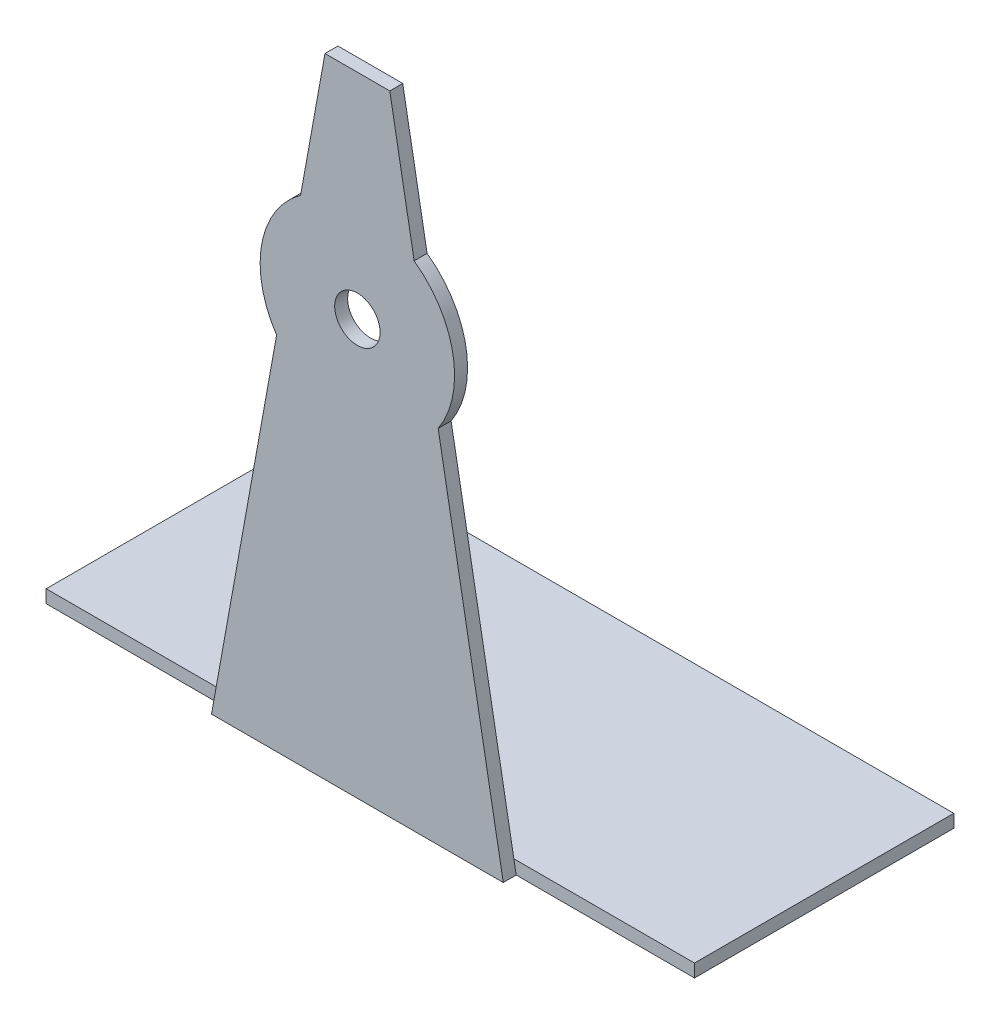
ISO-10303-21;
HEADER;
FILE_DESCRIPTION(('STEP AP214'),'2;1');
FILE_NAME('part.step','',(''),(''),'','','');
FILE_SCHEMA(('AUTOMOTIVE_DESIGN { 1 0 10303 214 1 1 1 1 }'));
ENDSEC;
DATA;
#1=APPLICATION_CONTEXT('core data for automotive mechanical design processes');
#2=APPLICATION_PROTOCOL_DEFINITION('international standard','automotive_design',2000,#1);
#3=PRODUCT_CONTEXT('',#1,'mechanical');
#4=PRODUCT('Part','Part','',(#3));
#5=PRODUCT_RELATED_PRODUCT_CATEGORY('part','',(#4));
#6=PRODUCT_DEFINITION_FORMATION('','',#4);
#7=PRODUCT_DEFINITION_CONTEXT('part definition',#1,'design');
#8=PRODUCT_DEFINITION('design','',#6,#7);
#9=PRODUCT_DEFINITION_SHAPE('','',#8);
#10=(LENGTH_UNIT() NAMED_UNIT(*) SI_UNIT(.MILLI.,.METRE.));
#11=(NAMED_UNIT(*) PLANE_ANGLE_UNIT() SI_UNIT($,.RADIAN.));
#12=(NAMED_UNIT(*) SI_UNIT($,.STERADIAN.) SOLID_ANGLE_UNIT());
#13=UNCERTAINTY_MEASURE_WITH_UNIT(LENGTH_MEASURE(1.E-05),#10,'distance_accuracy_value','');
#14=(GEOMETRIC_REPRESENTATION_CONTEXT(3) GLOBAL_UNCERTAINTY_ASSIGNED_CONTEXT((#13)) GLOBAL_UNIT_ASSIGNED_CONTEXT((#10,
#11,#12)) REPRESENTATION_CONTEXT('',''));
#15=CARTESIAN_POINT('',(0.,0.,0.));
#16=DIRECTION('',(0.,0.,1.));
#17=DIRECTION('',(1.,0.,0.));
#18=AXIS2_PLACEMENT_3D('',#15,#16,#17);
#19=CARTESIAN_POINT('',(0.,2.,0.));
#20=DIRECTION('',(0.,0.,-1.));
#21=DIRECTION('',(-1.,0.,0.));
#22=AXIS2_PLACEMENT_3D('',#19,#20,#21);
#23=PLANE('',#22);
#24=DIRECTION('',(-0.177546067858129,0.98411249041363,0.));
#25=VECTOR('',#24,1.);
#26=CARTESIAN_POINT('',(72.5,0.,0.));
#27=LINE('',#26,#25);
#28=CARTESIAN_POINT('',(72.5,0.,0.));
#29=VERTEX_POINT('',#28);
#30=CARTESIAN_POINT('',(72.139175257732,2.,0.));
#31=VERTEX_POINT('',#30);
#32=EDGE_CURVE('E249',#29,#31,#27,.T.);
#33=ORIENTED_EDGE('',*,*,#32,.F.);
#34=DIRECTION('',(1.,0.,0.));
#35=VECTOR('',#34,1.);
#36=CARTESIAN_POINT('',(0.,0.,0.));
#37=LINE('',#36,#35);
#38=CARTESIAN_POINT('',(100.,0.,0.));
#39=VERTEX_POINT('',#38);
#40=EDGE_CURVE('E169',#29,#39,#37,.T.);
#41=ORIENTED_EDGE('',*,*,#40,.T.);
#42=DIRECTION('',(0.,-1.,0.));
#43=VECTOR('',#42,1.);
#44=CARTESIAN_POINT('',(100.,2.,0.));
#45=LINE('',#44,#43);
#46=CARTESIAN_POINT('',(100.,2.,0.));
#47=VERTEX_POINT('',#46);
#48=EDGE_CURVE('E205',#47,#39,#45,.T.);
#49=ORIENTED_EDGE('',*,*,#48,.F.);
#50=DIRECTION('',(1.,0.,0.));
#51=VECTOR('',#50,1.);
#52=CARTESIAN_POINT('',(0.,2.,0.));
#53=LINE('',#52,#51);
#54=EDGE_CURVE('E57',#31,#47,#53,.T.);
#55=ORIENTED_EDGE('',*,*,#54,.F.);
#56=EDGE_LOOP('',(#33,#41,#49,#55));
#57=FACE_BOUND('',#56,.T.);
#58=ADVANCED_FACE('F39',(#57),#23,.F.);
#59=DIRECTION('',(-0.177546067858129,-0.98411249041363,0.));
#60=VECTOR('',#59,1.);
#61=CARTESIAN_POINT('',(27.5,0.,0.));
#62=LINE('',#61,#60);
#63=CARTESIAN_POINT('',(27.860824742268,2.,0.));
#64=VERTEX_POINT('',#63);
#65=CARTESIAN_POINT('',(27.5,0.,0.));
#66=VERTEX_POINT('',#65);
#67=EDGE_CURVE('E11',#64,#66,#62,.T.);
#68=ORIENTED_EDGE('',*,*,#67,.F.);
#69=CARTESIAN_POINT('',(0.,2.,0.));
#70=VERTEX_POINT('',#69);
#71=EDGE_CURVE('E180',#70,#64,#53,.T.);
#72=ORIENTED_EDGE('',*,*,#71,.F.);
#73=DIRECTION('',(0.,-1.,0.));
#74=VECTOR('',#73,1.);
#75=CARTESIAN_POINT('',(0.,2.,0.));
#76=LINE('',#75,#74);
#77=CARTESIAN_POINT('',(0.,0.,0.));
#78=VERTEX_POINT('',#77);
#79=EDGE_CURVE('E43',#70,#78,#76,.T.);
#80=ORIENTED_EDGE('',*,*,#79,.T.);
#81=EDGE_CURVE('E191',#78,#66,#37,.T.);
#82=ORIENTED_EDGE('',*,*,#81,.T.);
#83=EDGE_LOOP('',(#68,#72,#80,#82));
#84=FACE_BOUND('',#83,.T.);
#85=ADVANCED_FACE('F214',(#84),#23,.F.);
#86=CARTESIAN_POINT('',(0.,2.,0.));
#87=DIRECTION('',(1.,0.,0.));
#88=DIRECTION('',(0.,0.,-1.));
#89=AXIS2_PLACEMENT_3D('',#86,#87,#88);
#90=PLANE('',#89);
#91=DIRECTION('',(0.,0.,1.));
#92=VECTOR('',#91,1.);
#93=CARTESIAN_POINT('',(0.,0.,0.));
#94=LINE('',#93,#92);
#95=CARTESIAN_POINT('',(0.,0.,-40.));
#96=VERTEX_POINT('',#95);
#97=EDGE_CURVE('E164',#96,#78,#94,.T.);
#98=ORIENTED_EDGE('',*,*,#97,.T.);
#99=ORIENTED_EDGE('',*,*,#79,.F.);
#100=DIRECTION('',(0.,0.,1.));
#101=VECTOR('',#100,1.);
#102=CARTESIAN_POINT('',(0.,2.,0.));
#103=LINE('',#102,#101);
#104=CARTESIAN_POINT('',(0.,2.,-40.));
#105=VERTEX_POINT('',#104);
#106=EDGE_CURVE('E175',#105,#70,#103,.T.);
#107=ORIENTED_EDGE('',*,*,#106,.F.);
#108=DIRECTION('',(0.,-1.,0.));
#109=VECTOR('',#108,1.);
#110=CARTESIAN_POINT('',(0.,2.,-40.));
#111=LINE('',#110,#109);
#112=EDGE_CURVE('E189',#105,#96,#111,.T.);
#113=ORIENTED_EDGE('',*,*,#112,.T.);
#114=EDGE_LOOP('',(#98,#99,#107,#113));
#115=FACE_BOUND('',#114,.T.);
#116=ADVANCED_FACE('F41',(#115),#90,.F.);
#117=CARTESIAN_POINT('',(100.,2.,0.));
#118=DIRECTION('',(-1.,0.,0.));
#119=DIRECTION('',(0.,0.,1.));
#120=AXIS2_PLACEMENT_3D('',#117,#118,#119);
#121=PLANE('',#120);
#122=DIRECTION('',(0.,0.,-1.));
#123=VECTOR('',#122,1.);
#124=CARTESIAN_POINT('',(100.,0.,0.));
#125=LINE('',#124,#123);
#126=CARTESIAN_POINT('',(100.,0.,-40.));
#127=VERTEX_POINT('',#126);
#128=EDGE_CURVE('E194',#39,#127,#125,.T.);
#129=ORIENTED_EDGE('',*,*,#128,.T.);
#130=DIRECTION('',(0.,-1.,0.));
#131=VECTOR('',#130,1.);
#132=CARTESIAN_POINT('',(100.,2.,-40.));
#133=LINE('',#132,#131);
#134=CARTESIAN_POINT('',(100.,2.,-40.));
#135=VERTEX_POINT('',#134);
#136=EDGE_CURVE('E202',#135,#127,#133,.T.);
#137=ORIENTED_EDGE('',*,*,#136,.F.);
#138=DIRECTION('',(0.,0.,-1.));
#139=VECTOR('',#138,1.);
#140=CARTESIAN_POINT('',(100.,2.,0.));
#141=LINE('',#140,#139);
#142=EDGE_CURVE('E183',#47,#135,#141,.T.);
#143=ORIENTED_EDGE('',*,*,#142,.F.);
#144=ORIENTED_EDGE('',*,*,#48,.T.);
#145=EDGE_LOOP('',(#129,#137,#143,#144));
#146=FACE_BOUND('',#145,.T.);
#147=ADVANCED_FACE('F312',(#146),#121,.F.);
#148=CARTESIAN_POINT('',(0.,2.,-40.));
#149=DIRECTION('',(0.,0.,1.));
#150=DIRECTION('',(1.,0.,0.));
#151=AXIS2_PLACEMENT_3D('',#148,#149,#150);
#152=PLANE('',#151);
#153=DIRECTION('',(-1.,0.,0.));
#154=VECTOR('',#153,1.);
#155=CARTESIAN_POINT('',(0.,0.,-40.));
#156=LINE('',#155,#154);
#157=EDGE_CURVE('E179',#127,#96,#156,.T.);
#158=ORIENTED_EDGE('',*,*,#157,.T.);
#159=ORIENTED_EDGE('',*,*,#112,.F.);
#160=DIRECTION('',(-1.,0.,0.));
#161=VECTOR('',#160,1.);
#162=CARTESIAN_POINT('',(0.,2.,-40.));
#163=LINE('',#162,#161);
#164=EDGE_CURVE('E187',#135,#105,#163,.T.);
#165=ORIENTED_EDGE('',*,*,#164,.F.);
#166=ORIENTED_EDGE('',*,*,#136,.T.);
#167=EDGE_LOOP('',(#158,#159,#165,#166));
#168=FACE_BOUND('',#167,.T.);
#169=ADVANCED_FACE('F315',(#168),#152,.F.);
#170=CARTESIAN_POINT('',(0.,2.,0.));
#171=DIRECTION('',(0.,-1.,0.));
#172=DIRECTION('',(0.,0.,-1.));
#173=AXIS2_PLACEMENT_3D('',#170,#171,#172);
#174=PLANE('',#173);
#175=ORIENTED_EDGE('',*,*,#106,.T.);
#176=ORIENTED_EDGE('',*,*,#71,.T.);
#177=EDGE_CURVE('E184',#64,#31,#53,.T.);
#178=ORIENTED_EDGE('',*,*,#177,.T.);
#179=ORIENTED_EDGE('',*,*,#54,.T.);
#180=ORIENTED_EDGE('',*,*,#142,.T.);
#181=ORIENTED_EDGE('',*,*,#164,.T.);
#182=EDGE_LOOP('',(#175,#176,#178,#179,#180,#181));
#183=FACE_BOUND('',#182,.T.);
#184=ADVANCED_FACE('F310',(#183),#174,.F.);
#185=CARTESIAN_POINT('',(0.,0.,0.));
#186=DIRECTION('',(0.,-1.,0.));
#187=DIRECTION('',(0.,0.,-1.));
#188=AXIS2_PLACEMENT_3D('',#185,#186,#187);
#189=PLANE('',#188);
#190=ORIENTED_EDGE('',*,*,#97,.F.);
#191=ORIENTED_EDGE('',*,*,#157,.F.);
#192=ORIENTED_EDGE('',*,*,#128,.F.);
#193=ORIENTED_EDGE('',*,*,#40,.F.);
#194=DIRECTION('',(0.,0.,-1.));
#195=VECTOR('',#194,1.);
#196=CARTESIAN_POINT('',(72.5,0.,2.));
#197=LINE('',#196,#195);
#198=CARTESIAN_POINT('',(72.5,0.,2.));
#199=VERTEX_POINT('',#198);
#200=EDGE_CURVE('E171',#199,#29,#197,.T.);
#201=ORIENTED_EDGE('',*,*,#200,.F.);
#202=DIRECTION('',(1.,0.,0.));
#203=VECTOR('',#202,1.);
#204=CARTESIAN_POINT('',(72.5,0.,2.));
#205=LINE('',#204,#203);
#206=CARTESIAN_POINT('',(27.5,0.,2.));
#207=VERTEX_POINT('',#206);
#208=EDGE_CURVE('E147',#207,#199,#205,.T.);
#209=ORIENTED_EDGE('',*,*,#208,.F.);
#210=DIRECTION('',(0.,0.,-1.));
#211=VECTOR('',#210,1.);
#212=CARTESIAN_POINT('',(27.5,0.,2.));
#213=LINE('',#212,#211);
#214=EDGE_CURVE('E143',#207,#66,#213,.T.);
#215=ORIENTED_EDGE('',*,*,#214,.T.);
#216=ORIENTED_EDGE('',*,*,#81,.F.);
#217=EDGE_LOOP('',(#190,#191,#192,#193,#201,#209,#215,#216));
#218=FACE_BOUND('',#217,.T.);
#219=ADVANCED_FACE('F221',(#218),#189,.T.);
#220=CARTESIAN_POINT('',(50.,64.,2.));
#221=DIRECTION('',(0.,0.,-1.));
#222=DIRECTION('',(-1.,0.,0.));
#223=AXIS2_PLACEMENT_3D('',#220,#221,#222);
#224=CYLINDRICAL_SURFACE('',#223,15.);
#225=CARTESIAN_POINT('',(50.,64.,0.));
#226=DIRECTION('',(0.,0.,1.));
#227=DIRECTION('',(1.,0.,0.));
#228=AXIS2_PLACEMENT_3D('',#225,#226,#227);
#229=CIRCLE('',#228,15.);
#230=CARTESIAN_POINT('',(41.2436171170368,76.1789063058614,0.));
#231=VERTEX_POINT('',#230);
#232=CARTESIAN_POINT('',(37.5397389468833,55.648838734153,0.));
#233=VERTEX_POINT('',#232);
#234=EDGE_CURVE('E162',#231,#233,#229,.T.);
#235=ORIENTED_EDGE('',*,*,#234,.T.);
#236=DIRECTION('',(0.,0.,-1.));
#237=VECTOR('',#236,1.);
#238=CARTESIAN_POINT('',(37.5397389468833,55.648838734153,2.));
#239=LINE('',#238,#237);
#240=CARTESIAN_POINT('',(37.5397389468833,55.648838734153,2.));
#241=VERTEX_POINT('',#240);
#242=EDGE_CURVE('E140',#241,#233,#239,.T.);
#243=ORIENTED_EDGE('',*,*,#242,.F.);
#244=CARTESIAN_POINT('',(50.,64.,2.));
#245=DIRECTION('',(0.,0.,1.));
#246=DIRECTION('',(1.,0.,0.));
#247=AXIS2_PLACEMENT_3D('',#244,#245,#246);
#248=CIRCLE('',#247,15.);
#249=CARTESIAN_POINT('',(41.2436171170368,76.1789063058614,2.));
#250=VERTEX_POINT('',#249);
#251=EDGE_CURVE('E148',#250,#241,#248,.T.);
#252=ORIENTED_EDGE('',*,*,#251,.F.);
#253=DIRECTION('',(0.,0.,-1.));
#254=VECTOR('',#253,1.);
#255=CARTESIAN_POINT('',(41.2436171170368,76.1789063058614,2.));
#256=LINE('',#255,#254);
#257=EDGE_CURVE('E243',#250,#231,#256,.T.);
#258=ORIENTED_EDGE('',*,*,#257,.T.);
#259=EDGE_LOOP('',(#235,#243,#252,#258));
#260=FACE_BOUND('',#259,.T.);
#261=ADVANCED_FACE('F160',(#260),#224,.T.);
#262=CARTESIAN_POINT('',(27.5,0.,2.));
#263=DIRECTION('',(0.98411249041363,-0.177546067858129,0.));
#264=DIRECTION('',(0.177546067858129,0.98411249041363,0.));
#265=AXIS2_PLACEMENT_3D('',#262,#263,#264);
#266=PLANE('',#265);
#267=EDGE_CURVE('E50',#233,#64,#62,.T.);
#268=ORIENTED_EDGE('',*,*,#267,.T.);
#269=ORIENTED_EDGE('',*,*,#67,.T.);
#270=ORIENTED_EDGE('',*,*,#214,.F.);
#271=DIRECTION('',(-0.177546067858129,-0.98411249041363,0.));
#272=VECTOR('',#271,1.);
#273=CARTESIAN_POINT('',(27.5,0.,2.));
#274=LINE('',#273,#272);
#275=EDGE_CURVE('E135',#241,#207,#274,.T.);
#276=ORIENTED_EDGE('',*,*,#275,.F.);
#277=ORIENTED_EDGE('',*,*,#242,.T.);
#278=EDGE_LOOP('',(#268,#269,#270,#276,#277));
#279=FACE_BOUND('',#278,.T.);
#280=ADVANCED_FACE('F138',(#279),#266,.F.);
#281=CARTESIAN_POINT('',(72.5,0.,2.));
#282=DIRECTION('',(-0.98411249041363,-0.177546067858129,0.));
#283=DIRECTION('',(0.177546067858129,-0.98411249041363,0.));
#284=AXIS2_PLACEMENT_3D('',#281,#282,#283);
#285=PLANE('',#284);
#286=ORIENTED_EDGE('',*,*,#32,.T.);
#287=CARTESIAN_POINT('',(62.4602610531167,55.6488387341531,0.));
#288=VERTEX_POINT('',#287);
#289=EDGE_CURVE('E248',#31,#288,#27,.T.);
#290=ORIENTED_EDGE('',*,*,#289,.T.);
#291=DIRECTION('',(0.,0.,-1.));
#292=VECTOR('',#291,1.);
#293=CARTESIAN_POINT('',(62.4602610531167,55.6488387341531,2.));
#294=LINE('',#293,#292);
#295=CARTESIAN_POINT('',(62.4602610531167,55.6488387341531,2.));
#296=VERTEX_POINT('',#295);
#297=EDGE_CURVE('E278',#296,#288,#294,.T.);
#298=ORIENTED_EDGE('',*,*,#297,.F.);
#299=DIRECTION('',(-0.177546067858129,0.98411249041363,0.));
#300=VECTOR('',#299,1.);
#301=CARTESIAN_POINT('',(72.5,0.,2.));
#302=LINE('',#301,#300);
#303=EDGE_CURVE('E227',#199,#296,#302,.T.);
#304=ORIENTED_EDGE('',*,*,#303,.F.);
#305=ORIENTED_EDGE('',*,*,#200,.T.);
#306=EDGE_LOOP('',(#286,#290,#298,#304,#305));
#307=FACE_BOUND('',#306,.T.);
#308=ADVANCED_FACE('F283',(#307),#285,.F.);
#309=CARTESIAN_POINT('',(50.,64.,2.));
#310=DIRECTION('',(0.,0.,-1.));
#311=DIRECTION('',(-1.,0.,0.));
#312=AXIS2_PLACEMENT_3D('',#309,#310,#311);
#313=CYLINDRICAL_SURFACE('',#312,15.);
#314=CARTESIAN_POINT('',(50.,64.,0.));
#315=DIRECTION('',(0.,0.,1.));
#316=DIRECTION('',(-1.,0.,0.));
#317=AXIS2_PLACEMENT_3D('',#314,#315,#316);
#318=CIRCLE('',#317,15.);
#319=CARTESIAN_POINT('',(58.7563828829632,76.1789063058614,0.));
#320=VERTEX_POINT('',#319);
#321=EDGE_CURVE('E253',#288,#320,#318,.T.);
#322=ORIENTED_EDGE('',*,*,#321,.T.);
#323=DIRECTION('',(0.,0.,-1.));
#324=VECTOR('',#323,1.);
#325=CARTESIAN_POINT('',(58.7563828829632,76.1789063058614,2.));
#326=LINE('',#325,#324);
#327=CARTESIAN_POINT('',(58.7563828829632,76.1789063058614,2.));
#328=VERTEX_POINT('',#327);
#329=EDGE_CURVE('E274',#328,#320,#326,.T.);
#330=ORIENTED_EDGE('',*,*,#329,.F.);
#331=CARTESIAN_POINT('',(50.,64.,2.));
#332=DIRECTION('',(0.,0.,1.));
#333=DIRECTION('',(-1.,0.,0.));
#334=AXIS2_PLACEMENT_3D('',#331,#332,#333);
#335=CIRCLE('',#334,15.);
#336=EDGE_CURVE('E230',#296,#328,#335,.T.);
#337=ORIENTED_EDGE('',*,*,#336,.F.);
#338=ORIENTED_EDGE('',*,*,#297,.T.);
#339=EDGE_LOOP('',(#322,#330,#337,#338));
#340=FACE_BOUND('',#339,.T.);
#341=ADVANCED_FACE('F290',(#340),#313,.T.);
#342=CARTESIAN_POINT('',(58.7563828829632,76.1789063058614,2.));
#343=DIRECTION('',(-0.98411249041363,-0.177546067858129,0.));
#344=DIRECTION('',(0.177546067858129,-0.98411249041363,0.));
#345=AXIS2_PLACEMENT_3D('',#342,#343,#344);
#346=PLANE('',#345);
#347=DIRECTION('',(-0.177546067858129,0.98411249041363,0.));
#348=VECTOR('',#347,1.);
#349=CARTESIAN_POINT('',(58.7563828829632,76.1789063058614,0.));
#350=LINE('',#349,#348);
#351=CARTESIAN_POINT('',(55.,97.,0.));
#352=VERTEX_POINT('',#351);
#353=EDGE_CURVE('E256',#320,#352,#350,.T.);
#354=ORIENTED_EDGE('',*,*,#353,.T.);
#355=DIRECTION('',(0.,0.,-1.));
#356=VECTOR('',#355,1.);
#357=CARTESIAN_POINT('',(55.,97.,2.));
#358=LINE('',#357,#356);
#359=CARTESIAN_POINT('',(55.,97.,2.));
#360=VERTEX_POINT('',#359);
#361=EDGE_CURVE('E270',#360,#352,#358,.T.);
#362=ORIENTED_EDGE('',*,*,#361,.F.);
#363=DIRECTION('',(-0.177546067858129,0.98411249041363,0.));
#364=VECTOR('',#363,1.);
#365=CARTESIAN_POINT('',(58.7563828829632,76.1789063058614,2.));
#366=LINE('',#365,#364);
#367=EDGE_CURVE('E235',#328,#360,#366,.T.);
#368=ORIENTED_EDGE('',*,*,#367,.F.);
#369=ORIENTED_EDGE('',*,*,#329,.T.);
#370=EDGE_LOOP('',(#354,#362,#368,#369));
#371=FACE_BOUND('',#370,.T.);
#372=ADVANCED_FACE('F294',(#371),#346,.F.);
#373=CARTESIAN_POINT('',(45.,97.,2.));
#374=DIRECTION('',(0.,-1.,0.));
#375=DIRECTION('',(0.,0.,-1.));
#376=AXIS2_PLACEMENT_3D('',#373,#374,#375);
#377=PLANE('',#376);
#378=DIRECTION('',(-1.,0.,0.));
#379=VECTOR('',#378,1.);
#380=CARTESIAN_POINT('',(45.,97.,0.));
#381=LINE('',#380,#379);
#382=CARTESIAN_POINT('',(45.,97.,0.));
#383=VERTEX_POINT('',#382);
#384=EDGE_CURVE('E259',#352,#383,#381,.T.);
#385=ORIENTED_EDGE('',*,*,#384,.T.);
#386=DIRECTION('',(0.,0.,-1.));
#387=VECTOR('',#386,1.);
#388=CARTESIAN_POINT('',(45.,97.,2.));
#389=LINE('',#388,#387);
#390=CARTESIAN_POINT('',(45.,97.,2.));
#391=VERTEX_POINT('',#390);
#392=EDGE_CURVE('E266',#391,#383,#389,.T.);
#393=ORIENTED_EDGE('',*,*,#392,.F.);
#394=DIRECTION('',(-1.,0.,0.));
#395=VECTOR('',#394,1.);
#396=CARTESIAN_POINT('',(45.,97.,2.));
#397=LINE('',#396,#395);
#398=EDGE_CURVE('E238',#360,#391,#397,.T.);
#399=ORIENTED_EDGE('',*,*,#398,.F.);
#400=ORIENTED_EDGE('',*,*,#361,.T.);
#401=EDGE_LOOP('',(#385,#393,#399,#400));
#402=FACE_BOUND('',#401,.T.);
#403=ADVANCED_FACE('F299',(#402),#377,.F.);
#404=CARTESIAN_POINT('',(41.2436171170368,76.1789063058614,2.));
#405=DIRECTION('',(0.98411249041363,-0.177546067858129,0.));
#406=DIRECTION('',(0.177546067858129,0.98411249041363,0.));
#407=AXIS2_PLACEMENT_3D('',#404,#405,#406);
#408=PLANE('',#407);
#409=DIRECTION('',(-0.177546067858129,-0.98411249041363,0.));
#410=VECTOR('',#409,1.);
#411=CARTESIAN_POINT('',(41.2436171170368,76.1789063058614,0.));
#412=LINE('',#411,#410);
#413=EDGE_CURVE('E158',#383,#231,#412,.T.);
#414=ORIENTED_EDGE('',*,*,#413,.T.);
#415=ORIENTED_EDGE('',*,*,#257,.F.);
#416=DIRECTION('',(-0.177546067858129,-0.98411249041363,0.));
#417=VECTOR('',#416,1.);
#418=CARTESIAN_POINT('',(41.2436171170368,76.1789063058614,2.));
#419=LINE('',#418,#417);
#420=EDGE_CURVE('E153',#391,#250,#419,.T.);
#421=ORIENTED_EDGE('',*,*,#420,.F.);
#422=ORIENTED_EDGE('',*,*,#392,.T.);
#423=EDGE_LOOP('',(#414,#415,#421,#422));
#424=FACE_BOUND('',#423,.T.);
#425=ADVANCED_FACE('F302',(#424),#408,.F.);
#426=CARTESIAN_POINT('',(50.,64.,2.));
#427=DIRECTION('',(0.,0.,1.));
#428=DIRECTION('',(1.,0.,0.));
#429=AXIS2_PLACEMENT_3D('',#426,#427,#428);
#430=PLANE('',#429);
#431=CARTESIAN_POINT('',(50.,64.,2.));
#432=DIRECTION('',(0.,0.,1.));
#433=DIRECTION('',(1.,0.,0.));
#434=AXIS2_PLACEMENT_3D('',#431,#432,#433);
#435=CIRCLE('',#434,3.5);
#436=CARTESIAN_POINT('',(53.5,64.,2.));
#437=VERTEX_POINT('',#436);
#438=EDGE_CURVE('E457',#437,#437,#435,.T.);
#439=ORIENTED_EDGE('',*,*,#438,.F.);
#440=EDGE_LOOP('',(#439));
#441=FACE_BOUND('',#440,.T.);
#442=ORIENTED_EDGE('',*,*,#251,.T.);
#443=ORIENTED_EDGE('',*,*,#275,.T.);
#444=ORIENTED_EDGE('',*,*,#208,.T.);
#445=ORIENTED_EDGE('',*,*,#303,.T.);
#446=ORIENTED_EDGE('',*,*,#336,.T.);
#447=ORIENTED_EDGE('',*,*,#367,.T.);
#448=ORIENTED_EDGE('',*,*,#398,.T.);
#449=ORIENTED_EDGE('',*,*,#420,.T.);
#450=EDGE_LOOP('',(#442,#443,#444,#445,#446,#447,#448,#449));
#451=FACE_BOUND('',#450,.T.);
#452=ADVANCED_FACE('F151',(#441,#451),#430,.T.);
#453=CARTESIAN_POINT('',(50.,64.,0.));
#454=DIRECTION('',(0.,0.,1.));
#455=DIRECTION('',(1.,0.,0.));
#456=AXIS2_PLACEMENT_3D('',#453,#454,#455);
#457=PLANE('',#456);
#458=CARTESIAN_POINT('',(50.,64.,0.));
#459=DIRECTION('',(0.,0.,1.));
#460=DIRECTION('',(1.,0.,0.));
#461=AXIS2_PLACEMENT_3D('',#458,#459,#460);
#462=CIRCLE('',#461,3.5);
#463=CARTESIAN_POINT('',(53.5,64.,0.));
#464=VERTEX_POINT('',#463);
#465=EDGE_CURVE('E245',#464,#464,#462,.T.);
#466=ORIENTED_EDGE('',*,*,#465,.T.);
#467=EDGE_LOOP('',(#466));
#468=FACE_BOUND('',#467,.T.);
#469=ORIENTED_EDGE('',*,*,#177,.F.);
#470=ORIENTED_EDGE('',*,*,#267,.F.);
#471=ORIENTED_EDGE('',*,*,#234,.F.);
#472=ORIENTED_EDGE('',*,*,#413,.F.);
#473=ORIENTED_EDGE('',*,*,#384,.F.);
#474=ORIENTED_EDGE('',*,*,#353,.F.);
#475=ORIENTED_EDGE('',*,*,#321,.F.);
#476=ORIENTED_EDGE('',*,*,#289,.F.);
#477=EDGE_LOOP('',(#469,#470,#471,#472,#473,#474,#475,#476));
#478=FACE_BOUND('',#477,.T.);
#479=ADVANCED_FACE('F305',(#468,#478),#457,.F.);
#480=CARTESIAN_POINT('',(50.,64.,0.));
#481=DIRECTION('',(0.,0.,1.));
#482=DIRECTION('',(1.,0.,0.));
#483=AXIS2_PLACEMENT_3D('',#480,#481,#482);
#484=CYLINDRICAL_SURFACE('',#483,3.5);
#485=ORIENTED_EDGE('',*,*,#465,.F.);
#486=EDGE_LOOP('',(#485));
#487=FACE_BOUND('',#486,.T.);
#488=ORIENTED_EDGE('',*,*,#438,.T.);
#489=EDGE_LOOP('',(#488));
#490=FACE_BOUND('',#489,.T.);
#491=ADVANCED_FACE('F438',(#487,#490),#484,.F.);
#492=CLOSED_SHELL('',(#58,#85,#116,#147,#169,#184,#219,#261,#280,#308,#341,#372,#403,#425,#452,
#479,#491));
#493=MANIFOLD_SOLID_BREP('B2',#492);
#494=ADVANCED_BREP_SHAPE_REPRESENTATION('',(#18,#493),#14);
#495=SHAPE_DEFINITION_REPRESENTATION(#9,#494);
ENDSEC;
END-ISO-10303-21;
